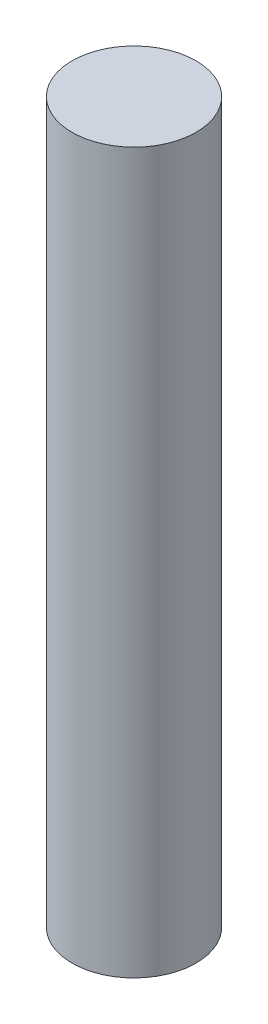
ISO-10303-21;
HEADER;
FILE_DESCRIPTION(('STEP AP214'),'2;1');
FILE_NAME('part.step','',(''),(''),'','','');
FILE_SCHEMA(('AUTOMOTIVE_DESIGN { 1 0 10303 214 1 1 1 1 }'));
ENDSEC;
DATA;
#1=APPLICATION_CONTEXT('core data for automotive mechanical design processes');
#2=APPLICATION_PROTOCOL_DEFINITION('international standard','automotive_design',2000,#1);
#3=PRODUCT_CONTEXT('',#1,'mechanical');
#4=PRODUCT('Part','Part','',(#3));
#5=PRODUCT_RELATED_PRODUCT_CATEGORY('part','',(#4));
#6=PRODUCT_DEFINITION_FORMATION('','',#4);
#7=PRODUCT_DEFINITION_CONTEXT('part definition',#1,'design');
#8=PRODUCT_DEFINITION('design','',#6,#7);
#9=PRODUCT_DEFINITION_SHAPE('','',#8);
#10=(LENGTH_UNIT() NAMED_UNIT(*) SI_UNIT(.MILLI.,.METRE.));
#11=(NAMED_UNIT(*) PLANE_ANGLE_UNIT() SI_UNIT($,.RADIAN.));
#12=(NAMED_UNIT(*) SI_UNIT($,.STERADIAN.) SOLID_ANGLE_UNIT());
#13=UNCERTAINTY_MEASURE_WITH_UNIT(LENGTH_MEASURE(1.E-05),#10,'distance_accuracy_value','');
#14=(GEOMETRIC_REPRESENTATION_CONTEXT(3) GLOBAL_UNCERTAINTY_ASSIGNED_CONTEXT((#13)) GLOBAL_UNIT_ASSIGNED_CONTEXT((#10,
#11,#12)) REPRESENTATION_CONTEXT('',''));
#15=CARTESIAN_POINT('',(0.,0.,0.));
#16=DIRECTION('',(0.,0.,1.));
#17=DIRECTION('',(1.,0.,0.));
#18=AXIS2_PLACEMENT_3D('',#15,#16,#17);
#19=CARTESIAN_POINT('',(7.00000000000001,-42.0682674199623,0.));
#20=DIRECTION('',(0.,-1.,0.));
#21=DIRECTION('',(0.,0.,-1.));
#22=AXIS2_PLACEMENT_3D('',#19,#20,#21);
#23=PLANE('',#22);
#24=CARTESIAN_POINT('',(0.,-42.0682674199623,0.));
#25=DIRECTION('',(0.,-1.,0.));
#26=DIRECTION('',(0.,0.,-1.));
#27=AXIS2_PLACEMENT_3D('',#24,#25,#26);
#28=CIRCLE('',#27,7.00000000000001);
#29=CARTESIAN_POINT('',(0.,-42.0682674199623,-7.00000000000001));
#30=VERTEX_POINT('',#29);
#31=EDGE_CURVE('E36',#30,#30,#28,.T.);
#32=ORIENTED_EDGE('',*,*,#31,.T.);
#33=EDGE_LOOP('',(#32));
#34=FACE_BOUND('',#33,.T.);
#35=ADVANCED_FACE('F30',(#34),#23,.T.);
#36=CARTESIAN_POINT('',(0.,39.1617325800377,0.));
#37=DIRECTION('',(0.,1.,0.));
#38=DIRECTION('',(0.,0.,1.));
#39=AXIS2_PLACEMENT_3D('',#36,#37,#38);
#40=PLANE('',#39);
#41=CARTESIAN_POINT('',(0.,39.1617325800377,0.));
#42=DIRECTION('',(0.,-1.,0.));
#43=DIRECTION('',(0.,0.,-1.));
#44=AXIS2_PLACEMENT_3D('',#41,#42,#43);
#45=CIRCLE('',#44,7.);
#46=CARTESIAN_POINT('',(0.,39.1617325800377,-7.));
#47=VERTEX_POINT('',#46);
#48=EDGE_CURVE('E10',#47,#47,#45,.T.);
#49=ORIENTED_EDGE('',*,*,#48,.F.);
#50=EDGE_LOOP('',(#49));
#51=FACE_BOUND('',#50,.T.);
#52=ADVANCED_FACE('F45',(#51),#40,.T.);
#53=CARTESIAN_POINT('',(0.,0.,0.));
#54=DIRECTION('',(0.,-1.,0.));
#55=DIRECTION('',(0.,0.,-1.));
#56=AXIS2_PLACEMENT_3D('',#53,#54,#55);
#57=CYLINDRICAL_SURFACE('',#56,7.);
#58=ORIENTED_EDGE('',*,*,#48,.T.);
#59=EDGE_LOOP('',(#58));
#60=FACE_BOUND('',#59,.T.);
#61=ORIENTED_EDGE('',*,*,#31,.F.);
#62=EDGE_LOOP('',(#61));
#63=FACE_BOUND('',#62,.T.);
#64=ADVANCED_FACE('F43',(#60,#63),#57,.T.);
#65=CLOSED_SHELL('',(#35,#52,#64));
#66=MANIFOLD_SOLID_BREP('B2',#65);
#67=ADVANCED_BREP_SHAPE_REPRESENTATION('',(#18,#66),#14);
#68=SHAPE_DEFINITION_REPRESENTATION(#9,#67);
ENDSEC;
END-ISO-10303-21;
